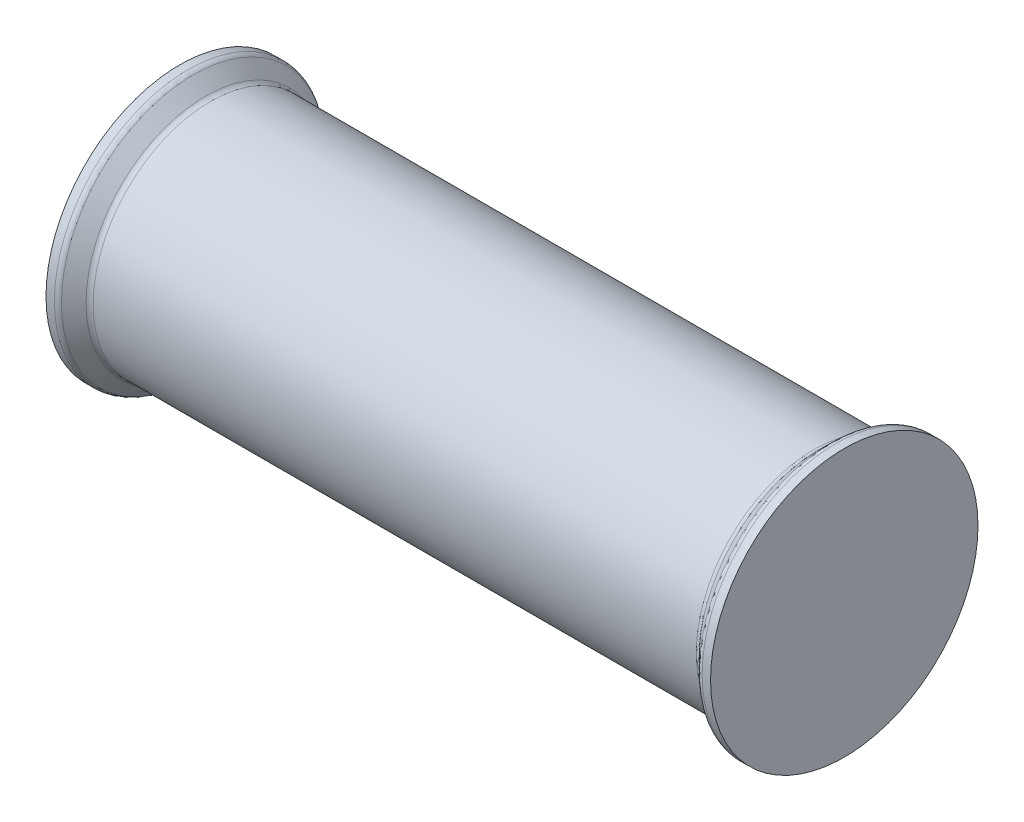
ISO-10303-21;
HEADER;
FILE_DESCRIPTION(('STEP AP214'),'2;1');
FILE_NAME('part.step','',(''),(''),'','','');
FILE_SCHEMA(('AUTOMOTIVE_DESIGN { 1 0 10303 214 1 1 1 1 }'));
ENDSEC;
DATA;
#1=APPLICATION_CONTEXT('core data for automotive mechanical design processes');
#2=APPLICATION_PROTOCOL_DEFINITION('international standard','automotive_design',2000,#1);
#3=PRODUCT_CONTEXT('',#1,'mechanical');
#4=PRODUCT('Part','Part','',(#3));
#5=PRODUCT_RELATED_PRODUCT_CATEGORY('part','',(#4));
#6=PRODUCT_DEFINITION_FORMATION('','',#4);
#7=PRODUCT_DEFINITION_CONTEXT('part definition',#1,'design');
#8=PRODUCT_DEFINITION('design','',#6,#7);
#9=PRODUCT_DEFINITION_SHAPE('','',#8);
#10=(LENGTH_UNIT() NAMED_UNIT(*) SI_UNIT(.MILLI.,.METRE.));
#11=(NAMED_UNIT(*) PLANE_ANGLE_UNIT() SI_UNIT($,.RADIAN.));
#12=(NAMED_UNIT(*) SI_UNIT($,.STERADIAN.) SOLID_ANGLE_UNIT());
#13=UNCERTAINTY_MEASURE_WITH_UNIT(LENGTH_MEASURE(1.E-05),#10,'distance_accuracy_value','');
#14=(GEOMETRIC_REPRESENTATION_CONTEXT(3) GLOBAL_UNCERTAINTY_ASSIGNED_CONTEXT((#13)) GLOBAL_UNIT_ASSIGNED_CONTEXT((#10,
#11,#12)) REPRESENTATION_CONTEXT('',''));
#15=CARTESIAN_POINT('',(0.,0.,0.));
#16=DIRECTION('',(0.,0.,1.));
#17=DIRECTION('',(1.,0.,0.));
#18=AXIS2_PLACEMENT_3D('',#15,#16,#17);
#19=CARTESIAN_POINT('',(-142.,-57.,0.));
#20=DIRECTION('',(1.,0.,0.));
#21=DIRECTION('',(0.,0.,-1.));
#22=AXIS2_PLACEMENT_3D('',#19,#20,#21);
#23=PLANE('',#22);
#24=CARTESIAN_POINT('',(-142.,0.,0.));
#25=DIRECTION('',(1.,0.,0.));
#26=DIRECTION('',(0.,0.,-1.));
#27=AXIS2_PLACEMENT_3D('',#24,#25,#26);
#28=CIRCLE('',#27,57.15);
#29=CARTESIAN_POINT('',(-142.,0.,-57.15));
#30=VERTEX_POINT('',#29);
#31=EDGE_CURVE('E18',#30,#30,#28,.T.);
#32=ORIENTED_EDGE('',*,*,#31,.F.);
#33=EDGE_LOOP('',(#32));
#34=FACE_BOUND('',#33,.T.);
#35=ADVANCED_FACE('F14',(#34),#23,.F.);
#36=CARTESIAN_POINT('',(142.,-57.,0.));
#37=DIRECTION('',(-1.,0.,0.));
#38=DIRECTION('',(0.,0.,1.));
#39=AXIS2_PLACEMENT_3D('',#36,#37,#38);
#40=PLANE('',#39);
#41=CARTESIAN_POINT('',(142.,0.,0.));
#42=DIRECTION('',(1.,0.,0.));
#43=DIRECTION('',(0.,0.,-1.));
#44=AXIS2_PLACEMENT_3D('',#41,#42,#43);
#45=CIRCLE('',#44,57.15);
#46=CARTESIAN_POINT('',(142.,0.,-57.15));
#47=VERTEX_POINT('',#46);
#48=EDGE_CURVE('E46',#47,#47,#45,.F.);
#49=ORIENTED_EDGE('',*,*,#48,.F.);
#50=EDGE_LOOP('',(#49));
#51=FACE_BOUND('',#50,.T.);
#52=ADVANCED_FACE('F57',(#51),#40,.F.);
#53=CARTESIAN_POINT('',(0.,0.,0.));
#54=DIRECTION('',(1.,0.,0.));
#55=DIRECTION('',(0.,0.,-1.));
#56=AXIS2_PLACEMENT_3D('',#53,#54,#55);
#57=CYLINDRICAL_SURFACE('',#56,57.15);
#58=ORIENTED_EDGE('',*,*,#31,.T.);
#59=EDGE_LOOP('',(#58));
#60=FACE_BOUND('',#59,.T.);
#61=CARTESIAN_POINT('',(-138.392640687119,0.,0.));
#62=DIRECTION('',(1.,0.,0.));
#63=DIRECTION('',(0.,0.,-1.));
#64=AXIS2_PLACEMENT_3D('',#61,#62,#63);
#65=CIRCLE('',#64,57.15);
#66=CARTESIAN_POINT('',(-138.392640687119,0.,-57.15));
#67=VERTEX_POINT('',#66);
#68=EDGE_CURVE('E44',#67,#67,#65,.T.);
#69=ORIENTED_EDGE('',*,*,#68,.F.);
#70=EDGE_LOOP('',(#69));
#71=FACE_BOUND('',#70,.T.);
#72=ADVANCED_FACE('F53',(#60,#71),#57,.T.);
#73=CARTESIAN_POINT('',(0.,0.,0.));
#74=DIRECTION('',(1.,0.,0.));
#75=DIRECTION('',(0.,0.,-1.));
#76=AXIS2_PLACEMENT_3D('',#73,#74,#75);
#77=CYLINDRICAL_SURFACE('',#76,57.15);
#78=ORIENTED_EDGE('',*,*,#48,.T.);
#79=EDGE_LOOP('',(#78));
#80=FACE_BOUND('',#79,.T.);
#81=CARTESIAN_POINT('',(138.392640687119,0.,0.));
#82=DIRECTION('',(-1.,0.,0.));
#83=DIRECTION('',(0.,0.,1.));
#84=AXIS2_PLACEMENT_3D('',#81,#82,#83);
#85=CIRCLE('',#84,57.15);
#86=CARTESIAN_POINT('',(138.392640687119,0.,57.15));
#87=VERTEX_POINT('',#86);
#88=EDGE_CURVE('E41',#87,#87,#85,.T.);
#89=ORIENTED_EDGE('',*,*,#88,.F.);
#90=EDGE_LOOP('',(#89));
#91=FACE_BOUND('',#90,.T.);
#92=ADVANCED_FACE('F85',(#80,#91),#77,.T.);
#93=CARTESIAN_POINT('',(-138.392640687119,0.,0.));
#94=DIRECTION('',(-1.,0.,0.));
#95=DIRECTION('',(0.,0.,1.));
#96=AXIS2_PLACEMENT_3D('',#93,#94,#95);
#97=TOROIDAL_SURFACE('',#96,54.15,2.99999999999994);
#98=CARTESIAN_POINT('',(-136.27132034356,0.,0.));
#99=DIRECTION('',(-1.,0.,0.));
#100=DIRECTION('',(0.,0.,1.));
#101=AXIS2_PLACEMENT_3D('',#98,#99,#100);
#102=CIRCLE('',#101,56.2713203435596);
#103=CARTESIAN_POINT('',(-136.27132034356,0.,56.2713203435596));
#104=VERTEX_POINT('',#103);
#105=EDGE_CURVE('E38',#104,#104,#102,.F.);
#106=ORIENTED_EDGE('',*,*,#105,.F.);
#107=EDGE_LOOP('',(#106));
#108=FACE_BOUND('',#107,.T.);
#109=ORIENTED_EDGE('',*,*,#68,.T.);
#110=EDGE_LOOP('',(#109));
#111=FACE_BOUND('',#110,.T.);
#112=ADVANCED_FACE('F88',(#108,#111),#97,.T.);
#113=CARTESIAN_POINT('',(138.392640687119,0.,0.));
#114=DIRECTION('',(1.,0.,0.));
#115=DIRECTION('',(0.,0.,-1.));
#116=AXIS2_PLACEMENT_3D('',#113,#114,#115);
#117=TOROIDAL_SURFACE('',#116,54.15,2.99999999999993);
#118=ORIENTED_EDGE('',*,*,#88,.T.);
#119=EDGE_LOOP('',(#118));
#120=FACE_BOUND('',#119,.T.);
#121=CARTESIAN_POINT('',(136.27132034356,0.,0.));
#122=DIRECTION('',(1.,0.,0.));
#123=DIRECTION('',(0.,0.,-1.));
#124=AXIS2_PLACEMENT_3D('',#121,#122,#123);
#125=CIRCLE('',#124,56.2713203435596);
#126=CARTESIAN_POINT('',(136.27132034356,0.,-56.2713203435596));
#127=VERTEX_POINT('',#126);
#128=EDGE_CURVE('E35',#127,#127,#125,.F.);
#129=ORIENTED_EDGE('',*,*,#128,.F.);
#130=EDGE_LOOP('',(#129));
#131=FACE_BOUND('',#130,.T.);
#132=ADVANCED_FACE('F83',(#120,#131),#117,.T.);
#133=CARTESIAN_POINT('',(-136.27132034356,0.,0.));
#134=DIRECTION('',(-1.,0.,0.));
#135=DIRECTION('',(0.,0.,1.));
#136=AXIS2_PLACEMENT_3D('',#133,#134,#135);
#137=CONICAL_SURFACE('',#136,56.2713203435596,0.78539816339745);
#138=CARTESIAN_POINT('',(-131.00867965644,0.,0.));
#139=DIRECTION('',(-1.,0.,0.));
#140=DIRECTION('',(0.,0.,1.));
#141=AXIS2_PLACEMENT_3D('',#138,#139,#140);
#142=CIRCLE('',#141,51.0086796564404);
#143=CARTESIAN_POINT('',(-131.00867965644,0.,51.0086796564404));
#144=VERTEX_POINT('',#143);
#145=EDGE_CURVE('E32',#144,#144,#142,.T.);
#146=ORIENTED_EDGE('',*,*,#145,.T.);
#147=EDGE_LOOP('',(#146));
#148=FACE_BOUND('',#147,.T.);
#149=ORIENTED_EDGE('',*,*,#105,.T.);
#150=EDGE_LOOP('',(#149));
#151=FACE_BOUND('',#150,.T.);
#152=ADVANCED_FACE('F79',(#148,#151),#137,.T.);
#153=CARTESIAN_POINT('',(136.27132034356,0.,0.));
#154=DIRECTION('',(1.,0.,0.));
#155=DIRECTION('',(0.,1.,0.));
#156=AXIS2_PLACEMENT_3D('',#153,#154,#155);
#157=CONICAL_SURFACE('',#156,56.2713203435596,0.78539816339745);
#158=ORIENTED_EDGE('',*,*,#128,.T.);
#159=EDGE_LOOP('',(#158));
#160=FACE_BOUND('',#159,.T.);
#161=CARTESIAN_POINT('',(131.00867965644,0.,0.));
#162=DIRECTION('',(1.,0.,0.));
#163=DIRECTION('',(0.,1.,0.));
#164=AXIS2_PLACEMENT_3D('',#161,#162,#163);
#165=CIRCLE('',#164,51.0086796564404);
#166=CARTESIAN_POINT('',(131.00867965644,51.0086796564404,0.));
#167=VERTEX_POINT('',#166);
#168=EDGE_CURVE('E27',#167,#167,#165,.T.);
#169=ORIENTED_EDGE('',*,*,#168,.T.);
#170=EDGE_LOOP('',(#169));
#171=FACE_BOUND('',#170,.T.);
#172=ADVANCED_FACE('F76',(#160,#171),#157,.T.);
#173=CARTESIAN_POINT('',(-128.887359312881,0.,0.));
#174=DIRECTION('',(1.,0.,0.));
#175=DIRECTION('',(0.,0.,-1.));
#176=AXIS2_PLACEMENT_3D('',#173,#174,#175);
#177=TOROIDAL_SURFACE('',#176,53.1300000000001,3.00000000000005);
#178=CARTESIAN_POINT('',(-128.887359312881,0.,0.));
#179=DIRECTION('',(1.,0.,0.));
#180=DIRECTION('',(0.,0.,-1.));
#181=AXIS2_PLACEMENT_3D('',#178,#179,#180);
#182=CIRCLE('',#181,50.13);
#183=CARTESIAN_POINT('',(-128.887359312881,0.,-50.13));
#184=VERTEX_POINT('',#183);
#185=EDGE_CURVE('E22',#184,#184,#182,.T.);
#186=ORIENTED_EDGE('',*,*,#185,.F.);
#187=EDGE_LOOP('',(#186));
#188=FACE_BOUND('',#187,.T.);
#189=ORIENTED_EDGE('',*,*,#145,.F.);
#190=EDGE_LOOP('',(#189));
#191=FACE_BOUND('',#190,.T.);
#192=ADVANCED_FACE('F72',(#188,#191),#177,.F.);
#193=CARTESIAN_POINT('',(128.887359312881,0.,0.));
#194=DIRECTION('',(1.,0.,0.));
#195=DIRECTION('',(0.,0.,-1.));
#196=AXIS2_PLACEMENT_3D('',#193,#194,#195);
#197=TOROIDAL_SURFACE('',#196,53.13,3.);
#198=ORIENTED_EDGE('',*,*,#168,.F.);
#199=EDGE_LOOP('',(#198));
#200=FACE_BOUND('',#199,.T.);
#201=CARTESIAN_POINT('',(128.887359312881,0.,0.));
#202=DIRECTION('',(1.,0.,0.));
#203=DIRECTION('',(0.,0.,-1.));
#204=AXIS2_PLACEMENT_3D('',#201,#202,#203);
#205=CIRCLE('',#204,50.13);
#206=CARTESIAN_POINT('',(128.887359312881,0.,-50.13));
#207=VERTEX_POINT('',#206);
#208=EDGE_CURVE('E10',#207,#207,#205,.F.);
#209=ORIENTED_EDGE('',*,*,#208,.F.);
#210=EDGE_LOOP('',(#209));
#211=FACE_BOUND('',#210,.T.);
#212=ADVANCED_FACE('F16',(#200,#211),#197,.F.);
#213=CARTESIAN_POINT('',(0.,0.,0.));
#214=DIRECTION('',(1.,0.,0.));
#215=DIRECTION('',(0.,0.,-1.));
#216=AXIS2_PLACEMENT_3D('',#213,#214,#215);
#217=CYLINDRICAL_SURFACE('',#216,50.13);
#218=ORIENTED_EDGE('',*,*,#208,.T.);
#219=EDGE_LOOP('',(#218));
#220=FACE_BOUND('',#219,.T.);
#221=ORIENTED_EDGE('',*,*,#185,.T.);
#222=EDGE_LOOP('',(#221));
#223=FACE_BOUND('',#222,.T.);
#224=ADVANCED_FACE('F66',(#220,#223),#217,.T.);
#225=CLOSED_SHELL('',(#35,#52,#72,#92,#112,#132,#152,#172,#192,#212,#224));
#226=MANIFOLD_SOLID_BREP('B1',#225);
#227=ADVANCED_BREP_SHAPE_REPRESENTATION('',(#18,#226),#14);
#228=SHAPE_DEFINITION_REPRESENTATION(#9,#227);
ENDSEC;
END-ISO-10303-21;
